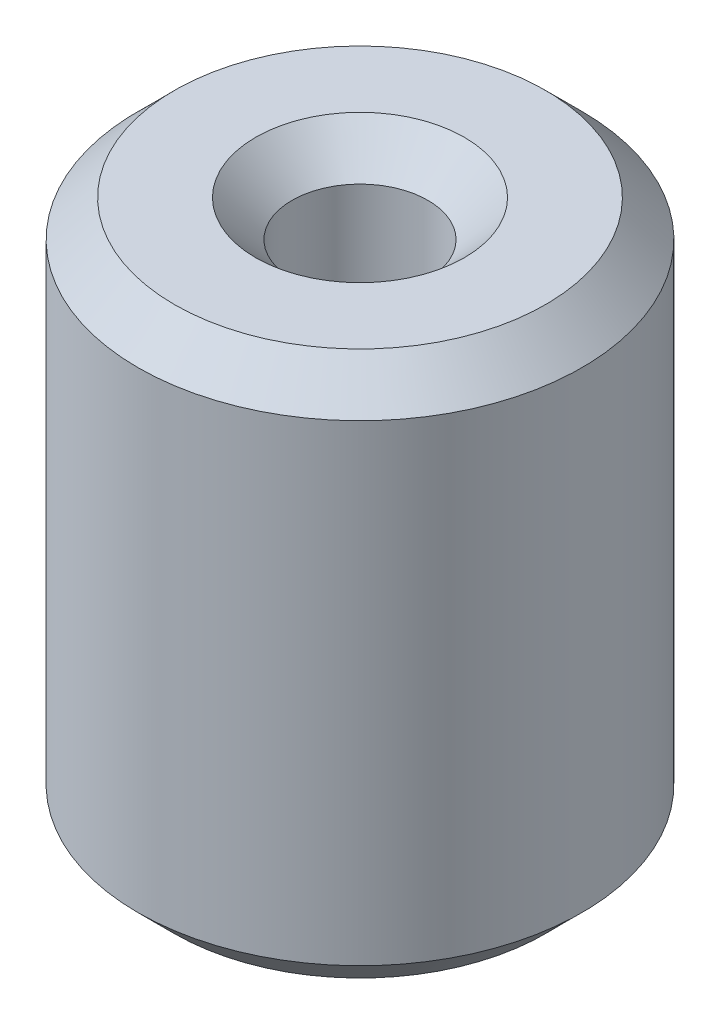
ISO-10303-21;
HEADER;
FILE_DESCRIPTION(('STEP AP214'),'2;1');
FILE_NAME('part.step','',(''),(''),'','','');
FILE_SCHEMA(('AUTOMOTIVE_DESIGN { 1 0 10303 214 1 1 1 1 }'));
ENDSEC;
DATA;
#1=APPLICATION_CONTEXT('core data for automotive mechanical design processes');
#2=APPLICATION_PROTOCOL_DEFINITION('international standard','automotive_design',2000,#1);
#3=PRODUCT_CONTEXT('',#1,'mechanical');
#4=PRODUCT('Part','Part','',(#3));
#5=PRODUCT_RELATED_PRODUCT_CATEGORY('part','',(#4));
#6=PRODUCT_DEFINITION_FORMATION('','',#4);
#7=PRODUCT_DEFINITION_CONTEXT('part definition',#1,'design');
#8=PRODUCT_DEFINITION('design','',#6,#7);
#9=PRODUCT_DEFINITION_SHAPE('','',#8);
#10=(LENGTH_UNIT() NAMED_UNIT(*) SI_UNIT(.MILLI.,.METRE.));
#11=(NAMED_UNIT(*) PLANE_ANGLE_UNIT() SI_UNIT($,.RADIAN.));
#12=(NAMED_UNIT(*) SI_UNIT($,.STERADIAN.) SOLID_ANGLE_UNIT());
#13=UNCERTAINTY_MEASURE_WITH_UNIT(LENGTH_MEASURE(1.E-05),#10,'distance_accuracy_value','');
#14=(GEOMETRIC_REPRESENTATION_CONTEXT(3) GLOBAL_UNCERTAINTY_ASSIGNED_CONTEXT((#13)) GLOBAL_UNIT_ASSIGNED_CONTEXT((#10,
#11,#12)) REPRESENTATION_CONTEXT('',''));
#15=CARTESIAN_POINT('',(0.,0.,0.));
#16=DIRECTION('',(0.,0.,1.));
#17=DIRECTION('',(1.,0.,0.));
#18=AXIS2_PLACEMENT_3D('',#15,#16,#17);
#19=CARTESIAN_POINT('',(0.,18.4088467894294,0.));
#20=DIRECTION('',(0.,-1.,0.));
#21=DIRECTION('',(0.,0.,-1.));
#22=AXIS2_PLACEMENT_3D('',#19,#20,#21);
#23=CYLINDRICAL_SURFACE('',#22,7.5);
#24=CARTESIAN_POINT('',(0.,1.23014924680723,0.));
#25=DIRECTION('',(0.,1.,0.));
#26=DIRECTION('',(0.,0.,1.));
#27=AXIS2_PLACEMENT_3D('',#24,#25,#26);
#28=CIRCLE('',#27,7.5);
#29=CARTESIAN_POINT('',(0.,1.23014924680723,7.5));
#30=VERTEX_POINT('',#29);
#31=EDGE_CURVE('E10',#30,#30,#28,.T.);
#32=ORIENTED_EDGE('',*,*,#31,.T.);
#33=EDGE_LOOP('',(#32));
#34=FACE_BOUND('',#33,.T.);
#35=CARTESIAN_POINT('',(0.,17.1786975426222,0.));
#36=DIRECTION('',(0.,1.,0.));
#37=DIRECTION('',(0.,0.,1.));
#38=AXIS2_PLACEMENT_3D('',#35,#36,#37);
#39=CIRCLE('',#38,7.5);
#40=CARTESIAN_POINT('',(0.,17.1786975426222,7.5));
#41=VERTEX_POINT('',#40);
#42=EDGE_CURVE('E50',#41,#41,#39,.F.);
#43=ORIENTED_EDGE('',*,*,#42,.T.);
#44=EDGE_LOOP('',(#43));
#45=FACE_BOUND('',#44,.T.);
#46=ADVANCED_FACE('F39',(#34,#45),#23,.T.);
#47=CARTESIAN_POINT('',(0.,18.4088467894294,0.));
#48=DIRECTION('',(0.,1.,0.));
#49=DIRECTION('',(0.,0.,1.));
#50=AXIS2_PLACEMENT_3D('',#47,#48,#49);
#51=PLANE('',#50);
#52=CARTESIAN_POINT('',(0.,18.4088467894294,0.));
#53=DIRECTION('',(0.,1.,0.));
#54=DIRECTION('',(0.,0.,1.));
#55=AXIS2_PLACEMENT_3D('',#52,#53,#54);
#56=CIRCLE('',#55,3.52633678321477);
#57=CARTESIAN_POINT('',(0.,18.4088467894294,3.52633678321477));
#58=VERTEX_POINT('',#57);
#59=EDGE_CURVE('E58',#58,#58,#56,.F.);
#60=ORIENTED_EDGE('',*,*,#59,.T.);
#61=EDGE_LOOP('',(#60));
#62=FACE_BOUND('',#61,.T.);
#63=CARTESIAN_POINT('',(0.,18.4088467894294,0.));
#64=DIRECTION('',(0.,1.,0.));
#65=DIRECTION('',(0.,0.,1.));
#66=AXIS2_PLACEMENT_3D('',#63,#64,#65);
#67=CIRCLE('',#66,6.26985075319276);
#68=CARTESIAN_POINT('',(0.,18.4088467894294,6.26985075319276));
#69=VERTEX_POINT('',#68);
#70=EDGE_CURVE('E61',#69,#69,#67,.T.);
#71=ORIENTED_EDGE('',*,*,#70,.T.);
#72=EDGE_LOOP('',(#71));
#73=FACE_BOUND('',#72,.T.);
#74=ADVANCED_FACE('F88',(#62,#73),#51,.T.);
#75=CARTESIAN_POINT('',(0.,0.,0.));
#76=DIRECTION('',(0.,1.,0.));
#77=DIRECTION('',(0.,0.,1.));
#78=AXIS2_PLACEMENT_3D('',#75,#76,#77);
#79=PLANE('',#78);
#80=CARTESIAN_POINT('',(0.,0.,0.));
#81=DIRECTION('',(0.,1.,0.));
#82=DIRECTION('',(0.,0.,1.));
#83=AXIS2_PLACEMENT_3D('',#80,#81,#82);
#84=CIRCLE('',#83,3.52633678321476);
#85=CARTESIAN_POINT('',(0.,0.,3.52633678321476));
#86=VERTEX_POINT('',#85);
#87=EDGE_CURVE('E51',#86,#86,#84,.T.);
#88=ORIENTED_EDGE('',*,*,#87,.T.);
#89=EDGE_LOOP('',(#88));
#90=FACE_BOUND('',#89,.T.);
#91=CARTESIAN_POINT('',(0.,0.,0.));
#92=DIRECTION('',(0.,1.,0.));
#93=DIRECTION('',(0.,0.,1.));
#94=AXIS2_PLACEMENT_3D('',#91,#92,#93);
#95=CIRCLE('',#94,6.26985075319276);
#96=CARTESIAN_POINT('',(0.,0.,6.26985075319276));
#97=VERTEX_POINT('',#96);
#98=EDGE_CURVE('E54',#97,#97,#95,.F.);
#99=ORIENTED_EDGE('',*,*,#98,.T.);
#100=EDGE_LOOP('',(#99));
#101=FACE_BOUND('',#100,.T.);
#102=ADVANCED_FACE('F83',(#90,#101),#79,.F.);
#103=CARTESIAN_POINT('',(0.,18.4088467894294,0.));
#104=DIRECTION('',(0.,-1.,0.));
#105=DIRECTION('',(0.,0.,-1.));
#106=AXIS2_PLACEMENT_3D('',#103,#104,#105);
#107=CYLINDRICAL_SURFACE('',#106,2.29618753640752);
#108=CARTESIAN_POINT('',(0.,17.1786975426222,0.));
#109=DIRECTION('',(0.,1.,0.));
#110=DIRECTION('',(0.,0.,1.));
#111=AXIS2_PLACEMENT_3D('',#108,#109,#110);
#112=CIRCLE('',#111,2.29618753640752);
#113=CARTESIAN_POINT('',(0.,17.1786975426222,2.29618753640752));
#114=VERTEX_POINT('',#113);
#115=EDGE_CURVE('E67',#114,#114,#112,.T.);
#116=ORIENTED_EDGE('',*,*,#115,.T.);
#117=EDGE_LOOP('',(#116));
#118=FACE_BOUND('',#117,.T.);
#119=CARTESIAN_POINT('',(0.,1.23014924680725,0.));
#120=DIRECTION('',(0.,1.,0.));
#121=DIRECTION('',(0.,0.,1.));
#122=AXIS2_PLACEMENT_3D('',#119,#120,#121);
#123=CIRCLE('',#122,2.29618753640752);
#124=CARTESIAN_POINT('',(0.,1.23014924680725,2.29618753640752));
#125=VERTEX_POINT('',#124);
#126=EDGE_CURVE('E69',#125,#125,#123,.F.);
#127=ORIENTED_EDGE('',*,*,#126,.T.);
#128=EDGE_LOOP('',(#127));
#129=FACE_BOUND('',#128,.T.);
#130=ADVANCED_FACE('F71',(#118,#129),#107,.F.);
#131=CARTESIAN_POINT('',(0.,17.1786975426222,0.));
#132=DIRECTION('',(0.,1.,0.));
#133=DIRECTION('',(0.,0.,1.));
#134=AXIS2_PLACEMENT_3D('',#131,#132,#133);
#135=CONICAL_SURFACE('',#134,2.29618753640752,0.785398163397451);
#136=ORIENTED_EDGE('',*,*,#59,.F.);
#137=EDGE_LOOP('',(#136));
#138=FACE_BOUND('',#137,.T.);
#139=ORIENTED_EDGE('',*,*,#115,.F.);
#140=EDGE_LOOP('',(#139));
#141=FACE_BOUND('',#140,.T.);
#142=ADVANCED_FACE('F77',(#138,#141),#135,.F.);
#143=CARTESIAN_POINT('',(0.,0.,0.));
#144=DIRECTION('',(0.,-1.,0.));
#145=DIRECTION('',(0.,0.,-1.));
#146=AXIS2_PLACEMENT_3D('',#143,#144,#145);
#147=CONICAL_SURFACE('',#146,3.52633678321476,0.785398163397445);
#148=ORIENTED_EDGE('',*,*,#126,.F.);
#149=EDGE_LOOP('',(#148));
#150=FACE_BOUND('',#149,.T.);
#151=ORIENTED_EDGE('',*,*,#87,.F.);
#152=EDGE_LOOP('',(#151));
#153=FACE_BOUND('',#152,.T.);
#154=ADVANCED_FACE('F73',(#150,#153),#147,.F.);
#155=CARTESIAN_POINT('',(0.,1.23014924680723,0.));
#156=DIRECTION('',(0.,1.,0.));
#157=DIRECTION('',(0.,0.,1.));
#158=AXIS2_PLACEMENT_3D('',#155,#156,#157);
#159=CONICAL_SURFACE('',#158,7.5,0.785398163397453);
#160=CARTESIAN_POINT('',(0.,0.,6.26985075319276));
#161=CARTESIAN_POINT('',(0.,0.0128140546542417,6.282664807847));
#162=CARTESIAN_POINT('',(0.,0.0256281093084837,6.29547886250124));
#163=CARTESIAN_POINT('',(0.,0.0512562186169678,6.32110697180972));
#164=CARTESIAN_POINT('',(0.,0.0640702732712098,6.33392102646397));
#165=CARTESIAN_POINT('',(0.,0.0896983825796938,6.35954913577245));
#166=CARTESIAN_POINT('',(0.,0.102512437233936,6.37236319042669));
#167=CARTESIAN_POINT('',(0.,0.12814054654242,6.39799129973518));
#168=CARTESIAN_POINT('',(0.,0.140954601196662,6.41080535438942));
#169=CARTESIAN_POINT('',(0.,0.166582710505146,6.4364334636979));
#170=CARTESIAN_POINT('',(0.,0.179396765159388,6.44924751835215));
#171=CARTESIAN_POINT('',(0.,0.205024874467872,6.47487562766063));
#172=CARTESIAN_POINT('',(0.,0.217838929122114,6.48768968231487));
#173=CARTESIAN_POINT('',(0.,0.243467038430597,6.51331779162336));
#174=CARTESIAN_POINT('',(0.,0.25628109308484,6.5261318462776));
#175=CARTESIAN_POINT('',(0.,0.281909202393324,6.55175995558608));
#176=CARTESIAN_POINT('',(0.,0.294723257047565,6.56457401024033));
#177=CARTESIAN_POINT('',(0.,0.320351366356049,6.59020211954881));
#178=CARTESIAN_POINT('',(0.,0.333165421010291,6.60301617420305));
#179=CARTESIAN_POINT('',(0.,0.358793530318775,6.62864428351154));
#180=CARTESIAN_POINT('',(0.,0.371607584973017,6.64145833816578));
#181=CARTESIAN_POINT('',(0.,0.397235694281501,6.66708644747426));
#182=CARTESIAN_POINT('',(0.,0.410049748935743,6.6799005021285));
#183=CARTESIAN_POINT('',(0.,0.435677858244227,6.70552861143699));
#184=CARTESIAN_POINT('',(0.,0.448491912898469,6.71834266609123));
#185=CARTESIAN_POINT('',(0.,0.474120022206953,6.74397077539971));
#186=CARTESIAN_POINT('',(0.,0.486934076861195,6.75678483005396));
#187=CARTESIAN_POINT('',(0.,0.512562186169679,6.78241293936244));
#188=CARTESIAN_POINT('',(0.,0.525376240823921,6.79522699401668));
#189=CARTESIAN_POINT('',(0.,0.551004350132405,6.82085510332517));
#190=CARTESIAN_POINT('',(0.,0.563818404786647,6.83366915797941));
#191=CARTESIAN_POINT('',(0.,0.589446514095131,6.85929726728789));
#192=CARTESIAN_POINT('',(0.,0.602260568749373,6.87211132194214));
#193=CARTESIAN_POINT('',(0.,0.627888678057857,6.89773943125062));
#194=CARTESIAN_POINT('',(0.,0.640702732712099,6.91055348590486));
#195=CARTESIAN_POINT('',(0.,0.666330842020583,6.93618159521335));
#196=CARTESIAN_POINT('',(0.,0.679144896674825,6.94899564986759));
#197=CARTESIAN_POINT('',(0.,0.704773005983309,6.97462375917607));
#198=CARTESIAN_POINT('',(0.,0.717587060637551,6.98743781383032));
#199=CARTESIAN_POINT('',(0.,0.743215169946035,7.0130659231388));
#200=CARTESIAN_POINT('',(0.,0.756029224600277,7.02587997779304));
#201=CARTESIAN_POINT('',(0.,0.781657333908761,7.05150808710153));
#202=CARTESIAN_POINT('',(0.,0.794471388563003,7.06432214175577));
#203=CARTESIAN_POINT('',(0.,0.820099497871487,7.08995025106425));
#204=CARTESIAN_POINT('',(0.,0.832913552525729,7.10276430571849));
#205=CARTESIAN_POINT('',(0.,0.858541661834213,7.12839241502698));
#206=CARTESIAN_POINT('',(0.,0.871355716488455,7.14120646968122));
#207=CARTESIAN_POINT('',(0.,0.896983825796939,7.1668345789897));
#208=CARTESIAN_POINT('',(0.,0.909797880451181,7.17964863364395));
#209=CARTESIAN_POINT('',(0.,0.935425989759665,7.20527674295243));
#210=CARTESIAN_POINT('',(0.,0.948240044413907,7.21809079760667));
#211=CARTESIAN_POINT('',(0.,0.973868153722391,7.24371890691516));
#212=CARTESIAN_POINT('',(0.,0.986682208376633,7.2565329615694));
#213=CARTESIAN_POINT('',(0.,1.01231031768512,7.28216107087788));
#214=CARTESIAN_POINT('',(0.,1.02512437233936,7.29497512553213));
#215=CARTESIAN_POINT('',(0.,1.05075248164784,7.32060323484061));
#216=CARTESIAN_POINT('',(0.,1.06356653630208,7.33341728949485));
#217=CARTESIAN_POINT('',(0.,1.08919464561057,7.35904539880334));
#218=CARTESIAN_POINT('',(0.,1.10200870026481,7.37185945345758));
#219=CARTESIAN_POINT('',(0.,1.12763680957329,7.39748756276606));
#220=CARTESIAN_POINT('',(0.,1.14045086422754,7.41030161742031));
#221=CARTESIAN_POINT('',(0.,1.16607897353602,7.43592972672879));
#222=CARTESIAN_POINT('',(0.,1.17889302819026,7.44874378138303));
#223=CARTESIAN_POINT('',(0.,1.20452113749875,7.47437189069151));
#224=CARTESIAN_POINT('',(0.,1.21733519215299,7.48718594534576));
#225=CARTESIAN_POINT('',(0.,1.23014924680723,7.5));
#226=B_SPLINE_CURVE_WITH_KNOTS('',3,(#160,#161,#162,#163,#164,#165,#166,#167,#168,#169,#170,
#171,#172,#173,#174,#175,#176,#177,#178,#179,#180,#181,#182,#183,#184,#185,#186,#187,#188,#189,
#190,#191,#192,#193,#194,#195,#196,#197,#198,#199,#200,#201,#202,#203,#204,#205,#206,#207,#208,
#209,#210,#211,#212,#213,#214,#215,#216,#217,#218,#219,#220,#221,#222,#223,#224,#225),
.UNSPECIFIED.,.F.,.F.,(4,2,2,2,2,2,2,2,2,2,2,2,2,2,2,2,2,2,2,2,2,2,2,2,2,2,2,2,2,2,2,2,4),(0.,
0.0543654296430579,0.108730859286115,0.163096288929173,0.217461718572231,0.271827148215288,
0.326192577858346,0.380558007501403,0.434923437144461,0.489288866787519,0.543654296430576,
0.598019726073634,0.652385155716691,0.706750585359749,0.761116015002806,0.815481444645864,
0.869846874288921,0.924212303931979,0.978577733575037,1.03294316321809,1.08730859286115,
1.14167402250421,1.19603945214727,1.25040488179032,1.30477031143338,1.35913574107644,
1.4135011707195,1.46786660036255,1.52223203000561,1.57659745964867,1.63096288929173,
1.68532831893478,1.73969374857784),.UNSPECIFIED.);
#227=EDGE_CURVE('BSEAM76',#97,#30,#226,.T.);
#228=ORIENTED_EDGE('',*,*,#98,.F.);
#229=ORIENTED_EDGE('',*,*,#31,.F.);
#230=ORIENTED_EDGE('',*,*,#227,.T.);
#231=ORIENTED_EDGE('',*,*,#227,.F.);
#232=EDGE_LOOP('',(#228,#230,#229,#231));
#233=FACE_BOUND('',#232,.T.);
#234=ADVANCED_FACE('F76',(#233),#159,.T.);
#235=CARTESIAN_POINT('',(0.,18.4088467894294,0.));
#236=DIRECTION('',(0.,-1.,0.));
#237=DIRECTION('',(0.,0.,-1.));
#238=AXIS2_PLACEMENT_3D('',#235,#236,#237);
#239=CONICAL_SURFACE('',#238,6.26985075319276,0.785398163397446);
#240=ORIENTED_EDGE('',*,*,#42,.F.);
#241=EDGE_LOOP('',(#240));
#242=FACE_BOUND('',#241,.T.);
#243=ORIENTED_EDGE('',*,*,#70,.F.);
#244=EDGE_LOOP('',(#243));
#245=FACE_BOUND('',#244,.T.);
#246=ADVANCED_FACE('F45',(#242,#245),#239,.T.);
#247=CLOSED_SHELL('',(#46,#74,#102,#130,#142,#154,#234,#246));
#248=MANIFOLD_SOLID_BREP('B2',#247);
#249=ADVANCED_BREP_SHAPE_REPRESENTATION('',(#18,#248),#14);
#250=SHAPE_DEFINITION_REPRESENTATION(#9,#249);
ENDSEC;
END-ISO-10303-21;
